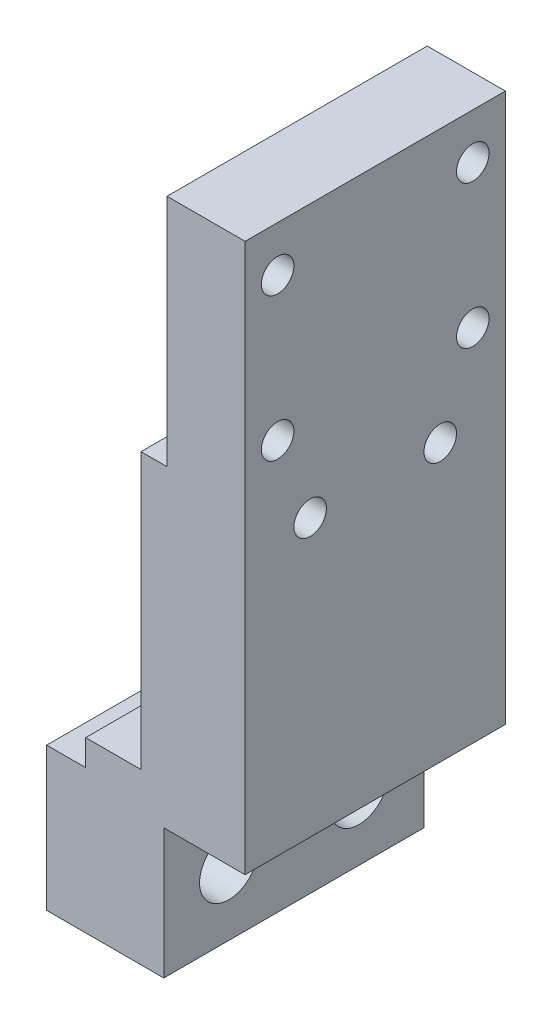
ISO-10303-21;
HEADER;
FILE_DESCRIPTION(('STEP AP214'),'2;1');
FILE_NAME('part.step','',(''),(''),'','','');
FILE_SCHEMA(('AUTOMOTIVE_DESIGN { 1 0 10303 214 1 1 1 1 }'));
ENDSEC;
DATA;
#1=APPLICATION_CONTEXT('core data for automotive mechanical design processes');
#2=APPLICATION_PROTOCOL_DEFINITION('international standard','automotive_design',2000,#1);
#3=PRODUCT_CONTEXT('',#1,'mechanical');
#4=PRODUCT('Part','Part','',(#3));
#5=PRODUCT_RELATED_PRODUCT_CATEGORY('part','',(#4));
#6=PRODUCT_DEFINITION_FORMATION('','',#4);
#7=PRODUCT_DEFINITION_CONTEXT('part definition',#1,'design');
#8=PRODUCT_DEFINITION('design','',#6,#7);
#9=PRODUCT_DEFINITION_SHAPE('','',#8);
#10=(LENGTH_UNIT() NAMED_UNIT(*) SI_UNIT(.MILLI.,.METRE.));
#11=(NAMED_UNIT(*) PLANE_ANGLE_UNIT() SI_UNIT($,.RADIAN.));
#12=(NAMED_UNIT(*) SI_UNIT($,.STERADIAN.) SOLID_ANGLE_UNIT());
#13=UNCERTAINTY_MEASURE_WITH_UNIT(LENGTH_MEASURE(1.E-05),#10,'distance_accuracy_value','');
#14=(GEOMETRIC_REPRESENTATION_CONTEXT(3) GLOBAL_UNCERTAINTY_ASSIGNED_CONTEXT((#13)) GLOBAL_UNIT_ASSIGNED_CONTEXT((#10,
#11,#12)) REPRESENTATION_CONTEXT('',''));
#15=CARTESIAN_POINT('',(0.,0.,0.));
#16=DIRECTION('',(0.,0.,1.));
#17=DIRECTION('',(1.,0.,0.));
#18=AXIS2_PLACEMENT_3D('',#15,#16,#17);
#19=CARTESIAN_POINT('',(-6.00000000000023,11.,20.));
#20=DIRECTION('',(1.,0.,0.));
#21=DIRECTION('',(0.,0.,-1.));
#22=AXIS2_PLACEMENT_3D('',#19,#20,#21);
#23=PLANE('',#22);
#24=DIRECTION('',(0.,-1.,0.));
#25=VECTOR('',#24,1.);
#26=CARTESIAN_POINT('',(-6.00000000000023,11.,0.));
#27=LINE('',#26,#25);
#28=CARTESIAN_POINT('',(-6.00000000000023,13.,0.));
#29=VERTEX_POINT('',#28);
#30=CARTESIAN_POINT('',(-6.00000000000023,11.,0.));
#31=VERTEX_POINT('',#30);
#32=EDGE_CURVE('E159',#29,#31,#27,.T.);
#33=ORIENTED_EDGE('',*,*,#32,.T.);
#34=DIRECTION('',(0.,0.,-1.));
#35=VECTOR('',#34,1.);
#36=CARTESIAN_POINT('',(-6.00000000000023,11.,20.));
#37=LINE('',#36,#35);
#38=CARTESIAN_POINT('',(-6.00000000000023,11.,20.));
#39=VERTEX_POINT('',#38);
#40=EDGE_CURVE('E11',#39,#31,#37,.T.);
#41=ORIENTED_EDGE('',*,*,#40,.F.);
#42=DIRECTION('',(0.,-1.,0.));
#43=VECTOR('',#42,1.);
#44=CARTESIAN_POINT('',(-6.00000000000023,11.,20.));
#45=LINE('',#44,#43);
#46=CARTESIAN_POINT('',(-6.00000000000023,13.,20.));
#47=VERTEX_POINT('',#46);
#48=EDGE_CURVE('E182',#47,#39,#45,.T.);
#49=ORIENTED_EDGE('',*,*,#48,.F.);
#50=DIRECTION('',(0.,0.,-1.));
#51=VECTOR('',#50,1.);
#52=CARTESIAN_POINT('',(-6.00000000000023,13.,20.));
#53=LINE('',#52,#51);
#54=EDGE_CURVE('E155',#47,#29,#53,.T.);
#55=ORIENTED_EDGE('',*,*,#54,.T.);
#56=EDGE_LOOP('',(#33,#41,#49,#55));
#57=FACE_BOUND('',#56,.T.);
#58=ADVANCED_FACE('F37',(#57),#23,.F.);
#59=CARTESIAN_POINT('',(-6.00000000000023,11.,20.));
#60=DIRECTION('',(0.,-1.,0.));
#61=DIRECTION('',(0.,0.,-1.));
#62=AXIS2_PLACEMENT_3D('',#59,#60,#61);
#63=PLANE('',#62);
#64=DIRECTION('',(-1.,0.,0.));
#65=VECTOR('',#64,1.);
#66=CARTESIAN_POINT('',(-6.00000000000023,11.,0.));
#67=LINE('',#66,#65);
#68=CARTESIAN_POINT('',(-9.00000000000034,11.,0.));
#69=VERTEX_POINT('',#68);
#70=EDGE_CURVE('E162',#31,#69,#67,.T.);
#71=ORIENTED_EDGE('',*,*,#70,.T.);
#72=DIRECTION('',(0.,0.,-1.));
#73=VECTOR('',#72,1.);
#74=CARTESIAN_POINT('',(-9.00000000000034,11.,20.));
#75=LINE('',#74,#73);
#76=CARTESIAN_POINT('',(-9.00000000000034,11.,20.));
#77=VERTEX_POINT('',#76);
#78=EDGE_CURVE('E46',#77,#69,#75,.T.);
#79=ORIENTED_EDGE('',*,*,#78,.F.);
#80=DIRECTION('',(-1.,0.,0.));
#81=VECTOR('',#80,1.);
#82=CARTESIAN_POINT('',(-6.00000000000023,11.,20.));
#83=LINE('',#82,#81);
#84=EDGE_CURVE('E110',#39,#77,#83,.T.);
#85=ORIENTED_EDGE('',*,*,#84,.F.);
#86=ORIENTED_EDGE('',*,*,#40,.T.);
#87=EDGE_LOOP('',(#71,#79,#85,#86));
#88=FACE_BOUND('',#87,.T.);
#89=ADVANCED_FACE('F297',(#88),#63,.F.);
#90=CARTESIAN_POINT('',(-9.00000000000034,0.,20.));
#91=DIRECTION('',(1.,0.,0.));
#92=DIRECTION('',(0.,0.,-1.));
#93=AXIS2_PLACEMENT_3D('',#90,#91,#92);
#94=PLANE('',#93);
#95=CARTESIAN_POINT('',(-9.00000000000034,4.96000000000009,5.));
#96=DIRECTION('',(-1.,0.,0.));
#97=DIRECTION('',(0.,0.,1.));
#98=AXIS2_PLACEMENT_3D('',#95,#96,#97);
#99=CIRCLE('',#98,3.99999999999999);
#100=CARTESIAN_POINT('',(-9.00000000000034,4.96000000000009,8.99999999999999));
#101=VERTEX_POINT('',#100);
#102=EDGE_CURVE('E546',#101,#101,#99,.T.);
#103=ORIENTED_EDGE('',*,*,#102,.F.);
#104=EDGE_LOOP('',(#103));
#105=FACE_BOUND('',#104,.T.);
#106=CARTESIAN_POINT('',(-9.00000000000034,4.96000000000009,15.));
#107=DIRECTION('',(-1.,0.,0.));
#108=DIRECTION('',(0.,0.,1.));
#109=AXIS2_PLACEMENT_3D('',#106,#107,#108);
#110=CIRCLE('',#109,3.99999999999999);
#111=CARTESIAN_POINT('',(-9.00000000000034,4.96000000000009,19.));
#112=VERTEX_POINT('',#111);
#113=EDGE_CURVE('E230',#112,#112,#110,.T.);
#114=ORIENTED_EDGE('',*,*,#113,.F.);
#115=EDGE_LOOP('',(#114));
#116=FACE_BOUND('',#115,.T.);
#117=DIRECTION('',(0.,-1.,0.));
#118=VECTOR('',#117,1.);
#119=CARTESIAN_POINT('',(-9.00000000000034,0.,0.));
#120=LINE('',#119,#118);
#121=CARTESIAN_POINT('',(-9.00000000000034,0.,0.));
#122=VERTEX_POINT('',#121);
#123=EDGE_CURVE('E165',#69,#122,#120,.T.);
#124=ORIENTED_EDGE('',*,*,#123,.T.);
#125=DIRECTION('',(0.,0.,-1.));
#126=VECTOR('',#125,1.);
#127=CARTESIAN_POINT('',(-9.00000000000034,0.,20.));
#128=LINE('',#127,#126);
#129=CARTESIAN_POINT('',(-9.00000000000034,0.,20.));
#130=VERTEX_POINT('',#129);
#131=EDGE_CURVE('E201',#130,#122,#128,.T.);
#132=ORIENTED_EDGE('',*,*,#131,.F.);
#133=DIRECTION('',(0.,-1.,0.));
#134=VECTOR('',#133,1.);
#135=CARTESIAN_POINT('',(-9.00000000000034,0.,20.));
#136=LINE('',#135,#134);
#137=EDGE_CURVE('E257',#77,#130,#136,.T.);
#138=ORIENTED_EDGE('',*,*,#137,.F.);
#139=ORIENTED_EDGE('',*,*,#78,.T.);
#140=EDGE_LOOP('',(#124,#132,#138,#139));
#141=FACE_BOUND('',#140,.T.);
#142=ADVANCED_FACE('F301',(#105,#116,#141),#94,.F.);
#143=CARTESIAN_POINT('',(0.,0.,20.));
#144=DIRECTION('',(0.,1.,0.));
#145=DIRECTION('',(0.,0.,1.));
#146=AXIS2_PLACEMENT_3D('',#143,#144,#145);
#147=PLANE('',#146);
#148=DIRECTION('',(1.,0.,0.));
#149=VECTOR('',#148,1.);
#150=CARTESIAN_POINT('',(0.,0.,0.));
#151=LINE('',#150,#149);
#152=CARTESIAN_POINT('',(0.,0.,0.));
#153=VERTEX_POINT('',#152);
#154=EDGE_CURVE('E167',#122,#153,#151,.T.);
#155=ORIENTED_EDGE('',*,*,#154,.T.);
#156=DIRECTION('',(0.,0.,-1.));
#157=VECTOR('',#156,1.);
#158=CARTESIAN_POINT('',(0.,0.,20.));
#159=LINE('',#158,#157);
#160=CARTESIAN_POINT('',(0.,0.,20.));
#161=VERTEX_POINT('',#160);
#162=EDGE_CURVE('E198',#161,#153,#159,.T.);
#163=ORIENTED_EDGE('',*,*,#162,.F.);
#164=DIRECTION('',(1.,0.,0.));
#165=VECTOR('',#164,1.);
#166=CARTESIAN_POINT('',(0.,0.,20.));
#167=LINE('',#166,#165);
#168=EDGE_CURVE('E259',#130,#161,#167,.T.);
#169=ORIENTED_EDGE('',*,*,#168,.F.);
#170=ORIENTED_EDGE('',*,*,#131,.T.);
#171=EDGE_LOOP('',(#155,#163,#169,#170));
#172=FACE_BOUND('',#171,.T.);
#173=ADVANCED_FACE('F305',(#172),#147,.F.);
#174=CARTESIAN_POINT('',(0.,10.,20.));
#175=DIRECTION('',(-1.,0.,0.));
#176=DIRECTION('',(0.,0.,1.));
#177=AXIS2_PLACEMENT_3D('',#174,#175,#176);
#178=PLANE('',#177);
#179=CARTESIAN_POINT('',(0.,4.96000000000009,5.));
#180=DIRECTION('',(-1.,0.,0.));
#181=DIRECTION('',(0.,0.,1.));
#182=AXIS2_PLACEMENT_3D('',#179,#180,#181);
#183=CIRCLE('',#182,2.25);
#184=CARTESIAN_POINT('',(0.,4.96000000000009,7.25));
#185=VERTEX_POINT('',#184);
#186=EDGE_CURVE('E40',#185,#185,#183,.T.);
#187=ORIENTED_EDGE('',*,*,#186,.T.);
#188=EDGE_LOOP('',(#187));
#189=FACE_BOUND('',#188,.T.);
#190=CARTESIAN_POINT('',(0.,4.96000000000009,15.));
#191=DIRECTION('',(-1.,0.,0.));
#192=DIRECTION('',(0.,0.,1.));
#193=AXIS2_PLACEMENT_3D('',#190,#191,#192);
#194=CIRCLE('',#193,2.25);
#195=CARTESIAN_POINT('',(0.,4.96000000000009,17.25));
#196=VERTEX_POINT('',#195);
#197=EDGE_CURVE('E215',#196,#196,#194,.T.);
#198=ORIENTED_EDGE('',*,*,#197,.T.);
#199=EDGE_LOOP('',(#198));
#200=FACE_BOUND('',#199,.T.);
#201=DIRECTION('',(0.,1.,0.));
#202=VECTOR('',#201,1.);
#203=CARTESIAN_POINT('',(0.,10.,0.));
#204=LINE('',#203,#202);
#205=CARTESIAN_POINT('',(0.,10.,0.));
#206=VERTEX_POINT('',#205);
#207=EDGE_CURVE('E169',#153,#206,#204,.T.);
#208=ORIENTED_EDGE('',*,*,#207,.T.);
#209=DIRECTION('',(0.,0.,-1.));
#210=VECTOR('',#209,1.);
#211=CARTESIAN_POINT('',(0.,10.,20.));
#212=LINE('',#211,#210);
#213=CARTESIAN_POINT('',(0.,10.,20.));
#214=VERTEX_POINT('',#213);
#215=EDGE_CURVE('E195',#214,#206,#212,.T.);
#216=ORIENTED_EDGE('',*,*,#215,.F.);
#217=DIRECTION('',(0.,1.,0.));
#218=VECTOR('',#217,1.);
#219=CARTESIAN_POINT('',(0.,10.,20.));
#220=LINE('',#219,#218);
#221=EDGE_CURVE('E261',#161,#214,#220,.T.);
#222=ORIENTED_EDGE('',*,*,#221,.F.);
#223=ORIENTED_EDGE('',*,*,#162,.T.);
#224=EDGE_LOOP('',(#208,#216,#222,#223));
#225=FACE_BOUND('',#224,.T.);
#226=ADVANCED_FACE('F311',(#189,#200,#225),#178,.F.);
#227=CARTESIAN_POINT('',(0.,10.,20.));
#228=DIRECTION('',(0.,1.,0.));
#229=DIRECTION('',(0.,0.,1.));
#230=AXIS2_PLACEMENT_3D('',#227,#228,#229);
#231=PLANE('',#230);
#232=DIRECTION('',(1.,0.,0.));
#233=VECTOR('',#232,1.);
#234=CARTESIAN_POINT('',(0.,10.,0.));
#235=LINE('',#234,#233);
#236=CARTESIAN_POINT('',(6.24999999999964,10.,0.));
#237=VERTEX_POINT('',#236);
#238=EDGE_CURVE('E171',#206,#237,#235,.T.);
#239=ORIENTED_EDGE('',*,*,#238,.T.);
#240=DIRECTION('',(0.,0.,-1.));
#241=VECTOR('',#240,1.);
#242=CARTESIAN_POINT('',(6.24999999999964,10.,20.));
#243=LINE('',#242,#241);
#244=CARTESIAN_POINT('',(6.24999999999964,10.,20.));
#245=VERTEX_POINT('',#244);
#246=EDGE_CURVE('E192',#245,#237,#243,.T.);
#247=ORIENTED_EDGE('',*,*,#246,.F.);
#248=DIRECTION('',(1.,0.,0.));
#249=VECTOR('',#248,1.);
#250=CARTESIAN_POINT('',(0.,10.,20.));
#251=LINE('',#250,#249);
#252=EDGE_CURVE('E263',#214,#245,#251,.T.);
#253=ORIENTED_EDGE('',*,*,#252,.F.);
#254=ORIENTED_EDGE('',*,*,#215,.T.);
#255=EDGE_LOOP('',(#239,#247,#253,#254));
#256=FACE_BOUND('',#255,.T.);
#257=ADVANCED_FACE('F315',(#256),#231,.F.);
#258=CARTESIAN_POINT('',(6.24999999999964,10.,20.));
#259=DIRECTION('',(-1.,0.,0.));
#260=DIRECTION('',(0.,0.,1.));
#261=AXIS2_PLACEMENT_3D('',#258,#259,#260);
#262=PLANE('',#261);
#263=CARTESIAN_POINT('',(6.24999999999965,48.6600000000001,2.5));
#264=DIRECTION('',(1.,0.,0.));
#265=DIRECTION('',(0.,0.,-1.));
#266=AXIS2_PLACEMENT_3D('',#263,#264,#265);
#267=CIRCLE('',#266,1.24999999999999);
#268=CARTESIAN_POINT('',(6.24999999999965,48.6600000000001,1.25000000000001));
#269=VERTEX_POINT('',#268);
#270=EDGE_CURVE('E217',#269,#269,#267,.T.);
#271=ORIENTED_EDGE('',*,*,#270,.F.);
#272=EDGE_LOOP('',(#271));
#273=FACE_BOUND('',#272,.T.);
#274=CARTESIAN_POINT('',(6.24999999999965,37.6600000000001,2.5));
#275=DIRECTION('',(1.,0.,0.));
#276=DIRECTION('',(0.,0.,-1.));
#277=AXIS2_PLACEMENT_3D('',#274,#275,#276);
#278=CIRCLE('',#277,1.24999999999999);
#279=CARTESIAN_POINT('',(6.24999999999965,37.6600000000001,1.25000000000001));
#280=VERTEX_POINT('',#279);
#281=EDGE_CURVE('E236',#280,#280,#278,.T.);
#282=ORIENTED_EDGE('',*,*,#281,.F.);
#283=EDGE_LOOP('',(#282));
#284=FACE_BOUND('',#283,.T.);
#285=CARTESIAN_POINT('',(6.24999999999965,31.2600000000001,5.));
#286=DIRECTION('',(1.,0.,0.));
#287=DIRECTION('',(0.,0.,-1.));
#288=AXIS2_PLACEMENT_3D('',#285,#286,#287);
#289=CIRCLE('',#288,1.24999999999999);
#290=CARTESIAN_POINT('',(6.24999999999965,31.2600000000001,3.75000000000001));
#291=VERTEX_POINT('',#290);
#292=EDGE_CURVE('E214',#291,#291,#289,.T.);
#293=ORIENTED_EDGE('',*,*,#292,.F.);
#294=EDGE_LOOP('',(#293));
#295=FACE_BOUND('',#294,.T.);
#296=CARTESIAN_POINT('',(6.24999999999965,31.2600000000001,15.));
#297=DIRECTION('',(1.,0.,0.));
#298=DIRECTION('',(0.,0.,-1.));
#299=AXIS2_PLACEMENT_3D('',#296,#297,#298);
#300=CIRCLE('',#299,1.24999999999999);
#301=CARTESIAN_POINT('',(6.24999999999965,31.2600000000001,13.75));
#302=VERTEX_POINT('',#301);
#303=EDGE_CURVE('E213',#302,#302,#300,.T.);
#304=ORIENTED_EDGE('',*,*,#303,.F.);
#305=EDGE_LOOP('',(#304));
#306=FACE_BOUND('',#305,.T.);
#307=CARTESIAN_POINT('',(6.24999999999965,37.6600000000001,17.5));
#308=DIRECTION('',(1.,0.,0.));
#309=DIRECTION('',(0.,0.,-1.));
#310=AXIS2_PLACEMENT_3D('',#307,#308,#309);
#311=CIRCLE('',#310,1.24999999999999);
#312=CARTESIAN_POINT('',(6.24999999999965,37.6600000000001,16.25));
#313=VERTEX_POINT('',#312);
#314=EDGE_CURVE('E210',#313,#313,#311,.T.);
#315=ORIENTED_EDGE('',*,*,#314,.F.);
#316=EDGE_LOOP('',(#315));
#317=FACE_BOUND('',#316,.T.);
#318=CARTESIAN_POINT('',(6.24999999999965,48.6600000000001,17.5));
#319=DIRECTION('',(1.,0.,0.));
#320=DIRECTION('',(0.,0.,-1.));
#321=AXIS2_PLACEMENT_3D('',#318,#319,#320);
#322=CIRCLE('',#321,1.24999999999999);
#323=CARTESIAN_POINT('',(6.24999999999965,48.6600000000001,16.25));
#324=VERTEX_POINT('',#323);
#325=EDGE_CURVE('E209',#324,#324,#322,.T.);
#326=ORIENTED_EDGE('',*,*,#325,.F.);
#327=EDGE_LOOP('',(#326));
#328=FACE_BOUND('',#327,.T.);
#329=DIRECTION('',(0.,1.,0.));
#330=VECTOR('',#329,1.);
#331=CARTESIAN_POINT('',(6.24999999999964,10.,0.));
#332=LINE('',#331,#330);
#333=CARTESIAN_POINT('',(6.24999999999964,52.1600000000001,0.));
#334=VERTEX_POINT('',#333);
#335=EDGE_CURVE('E173',#237,#334,#332,.T.);
#336=ORIENTED_EDGE('',*,*,#335,.T.);
#337=DIRECTION('',(0.,0.,-1.));
#338=VECTOR('',#337,1.);
#339=CARTESIAN_POINT('',(6.24999999999964,52.1600000000001,20.));
#340=LINE('',#339,#338);
#341=CARTESIAN_POINT('',(6.24999999999964,52.1600000000001,20.));
#342=VERTEX_POINT('',#341);
#343=EDGE_CURVE('E189',#342,#334,#340,.T.);
#344=ORIENTED_EDGE('',*,*,#343,.F.);
#345=DIRECTION('',(0.,1.,0.));
#346=VECTOR('',#345,1.);
#347=CARTESIAN_POINT('',(6.24999999999964,10.,20.));
#348=LINE('',#347,#346);
#349=EDGE_CURVE('E265',#245,#342,#348,.T.);
#350=ORIENTED_EDGE('',*,*,#349,.F.);
#351=ORIENTED_EDGE('',*,*,#246,.T.);
#352=EDGE_LOOP('',(#336,#344,#350,#351));
#353=FACE_BOUND('',#352,.T.);
#354=ADVANCED_FACE('F319',(#273,#284,#295,#306,#317,#328,#353),#262,.F.);
#355=CARTESIAN_POINT('',(0.249999999998085,52.1600000000001,20.));
#356=DIRECTION('',(0.,-1.,0.));
#357=DIRECTION('',(0.,0.,-1.));
#358=AXIS2_PLACEMENT_3D('',#355,#356,#357);
#359=PLANE('',#358);
#360=DIRECTION('',(-1.,0.,0.));
#361=VECTOR('',#360,1.);
#362=CARTESIAN_POINT('',(0.249999999998085,52.1600000000001,0.));
#363=LINE('',#362,#361);
#364=CARTESIAN_POINT('',(0.249999999998085,52.1600000000001,0.));
#365=VERTEX_POINT('',#364);
#366=EDGE_CURVE('E175',#334,#365,#363,.T.);
#367=ORIENTED_EDGE('',*,*,#366,.T.);
#368=DIRECTION('',(0.,0.,-1.));
#369=VECTOR('',#368,1.);
#370=CARTESIAN_POINT('',(0.249999999998085,52.1600000000001,20.));
#371=LINE('',#370,#369);
#372=CARTESIAN_POINT('',(0.249999999998085,52.1600000000001,20.));
#373=VERTEX_POINT('',#372);
#374=EDGE_CURVE('E186',#373,#365,#371,.T.);
#375=ORIENTED_EDGE('',*,*,#374,.F.);
#376=DIRECTION('',(-1.,0.,0.));
#377=VECTOR('',#376,1.);
#378=CARTESIAN_POINT('',(0.249999999998085,52.1600000000001,20.));
#379=LINE('',#378,#377);
#380=EDGE_CURVE('E267',#342,#373,#379,.T.);
#381=ORIENTED_EDGE('',*,*,#380,.F.);
#382=ORIENTED_EDGE('',*,*,#343,.T.);
#383=EDGE_LOOP('',(#367,#375,#381,#382));
#384=FACE_BOUND('',#383,.T.);
#385=ADVANCED_FACE('F273',(#384),#359,.F.);
#386=CARTESIAN_POINT('',(0.249999999998085,34.1600000000001,20.));
#387=DIRECTION('',(1.,0.,0.));
#388=DIRECTION('',(0.,0.,-1.));
#389=AXIS2_PLACEMENT_3D('',#386,#387,#388);
#390=PLANE('',#389);
#391=CARTESIAN_POINT('',(0.249999999998085,48.6600000000001,2.5));
#392=DIRECTION('',(1.,0.,0.));
#393=DIRECTION('',(0.,0.,-1.));
#394=AXIS2_PLACEMENT_3D('',#391,#392,#393);
#395=CIRCLE('',#394,1.24999999999999);
#396=CARTESIAN_POINT('',(0.249999999998085,48.6600000000001,1.25000000000001));
#397=VERTEX_POINT('',#396);
#398=EDGE_CURVE('E222',#397,#397,#395,.T.);
#399=ORIENTED_EDGE('',*,*,#398,.T.);
#400=EDGE_LOOP('',(#399));
#401=FACE_BOUND('',#400,.T.);
#402=CARTESIAN_POINT('',(0.249999999998085,37.6600000000001,2.5));
#403=DIRECTION('',(1.,0.,0.));
#404=DIRECTION('',(0.,0.,-1.));
#405=AXIS2_PLACEMENT_3D('',#402,#403,#404);
#406=CIRCLE('',#405,1.24999999999999);
#407=CARTESIAN_POINT('',(0.249999999998085,37.6600000000001,1.25000000000001));
#408=VERTEX_POINT('',#407);
#409=EDGE_CURVE('E239',#408,#408,#406,.T.);
#410=ORIENTED_EDGE('',*,*,#409,.T.);
#411=EDGE_LOOP('',(#410));
#412=FACE_BOUND('',#411,.T.);
#413=CARTESIAN_POINT('',(0.249999999998085,37.6600000000001,17.5));
#414=DIRECTION('',(1.,0.,0.));
#415=DIRECTION('',(0.,0.,-1.));
#416=AXIS2_PLACEMENT_3D('',#413,#414,#415);
#417=CIRCLE('',#416,1.24999999999999);
#418=CARTESIAN_POINT('',(0.249999999998085,37.6600000000001,16.25));
#419=VERTEX_POINT('',#418);
#420=EDGE_CURVE('E206',#419,#419,#417,.T.);
#421=ORIENTED_EDGE('',*,*,#420,.T.);
#422=EDGE_LOOP('',(#421));
#423=FACE_BOUND('',#422,.T.);
#424=CARTESIAN_POINT('',(0.249999999998085,48.6600000000001,17.5));
#425=DIRECTION('',(1.,0.,0.));
#426=DIRECTION('',(0.,0.,-1.));
#427=AXIS2_PLACEMENT_3D('',#424,#425,#426);
#428=CIRCLE('',#427,1.24999999999999);
#429=CARTESIAN_POINT('',(0.249999999998085,48.6600000000001,16.25));
#430=VERTEX_POINT('',#429);
#431=EDGE_CURVE('E163',#430,#430,#428,.T.);
#432=ORIENTED_EDGE('',*,*,#431,.T.);
#433=EDGE_LOOP('',(#432));
#434=FACE_BOUND('',#433,.T.);
#435=DIRECTION('',(0.,-1.,0.));
#436=VECTOR('',#435,1.);
#437=CARTESIAN_POINT('',(0.249999999998085,34.1600000000001,0.));
#438=LINE('',#437,#436);
#439=CARTESIAN_POINT('',(0.249999999998085,34.1600000000001,0.));
#440=VERTEX_POINT('',#439);
#441=EDGE_CURVE('E177',#365,#440,#438,.T.);
#442=ORIENTED_EDGE('',*,*,#441,.T.);
#443=DIRECTION('',(0.,0.,-1.));
#444=VECTOR('',#443,1.);
#445=CARTESIAN_POINT('',(0.249999999998085,34.1600000000001,20.));
#446=LINE('',#445,#444);
#447=CARTESIAN_POINT('',(0.249999999998085,34.1600000000001,20.));
#448=VERTEX_POINT('',#447);
#449=EDGE_CURVE('E150',#448,#440,#446,.T.);
#450=ORIENTED_EDGE('',*,*,#449,.F.);
#451=DIRECTION('',(0.,-1.,0.));
#452=VECTOR('',#451,1.);
#453=CARTESIAN_POINT('',(0.249999999998085,34.1600000000001,20.));
#454=LINE('',#453,#452);
#455=EDGE_CURVE('E141',#373,#448,#454,.T.);
#456=ORIENTED_EDGE('',*,*,#455,.F.);
#457=ORIENTED_EDGE('',*,*,#374,.T.);
#458=EDGE_LOOP('',(#442,#450,#456,#457));
#459=FACE_BOUND('',#458,.T.);
#460=ADVANCED_FACE('F277',(#401,#412,#423,#434,#459),#390,.F.);
#461=CARTESIAN_POINT('',(0.249999999998085,34.1600000000001,20.));
#462=DIRECTION('',(0.,-1.,0.));
#463=DIRECTION('',(0.,0.,-1.));
#464=AXIS2_PLACEMENT_3D('',#461,#462,#463);
#465=PLANE('',#464);
#466=DIRECTION('',(-1.,0.,0.));
#467=VECTOR('',#466,1.);
#468=CARTESIAN_POINT('',(0.249999999998085,34.1600000000001,0.));
#469=LINE('',#468,#467);
#470=CARTESIAN_POINT('',(-1.75000000000214,34.1600000000001,0.));
#471=VERTEX_POINT('',#470);
#472=EDGE_CURVE('E149',#440,#471,#469,.T.);
#473=ORIENTED_EDGE('',*,*,#472,.T.);
#474=DIRECTION('',(0.,0.,-1.));
#475=VECTOR('',#474,1.);
#476=CARTESIAN_POINT('',(-1.75000000000214,34.1600000000001,20.));
#477=LINE('',#476,#475);
#478=CARTESIAN_POINT('',(-1.75000000000214,34.1600000000001,20.));
#479=VERTEX_POINT('',#478);
#480=EDGE_CURVE('E146',#479,#471,#477,.T.);
#481=ORIENTED_EDGE('',*,*,#480,.F.);
#482=DIRECTION('',(-1.,0.,0.));
#483=VECTOR('',#482,1.);
#484=CARTESIAN_POINT('',(0.249999999998085,34.1600000000001,20.));
#485=LINE('',#484,#483);
#486=EDGE_CURVE('E135',#448,#479,#485,.T.);
#487=ORIENTED_EDGE('',*,*,#486,.F.);
#488=ORIENTED_EDGE('',*,*,#449,.T.);
#489=EDGE_LOOP('',(#473,#481,#487,#488));
#490=FACE_BOUND('',#489,.T.);
#491=ADVANCED_FACE('F147',(#490),#465,.F.);
#492=CARTESIAN_POINT('',(-1.75000000000214,34.1600000000001,20.));
#493=DIRECTION('',(1.,0.,0.));
#494=DIRECTION('',(0.,0.,-1.));
#495=AXIS2_PLACEMENT_3D('',#492,#493,#494);
#496=PLANE('',#495);
#497=CARTESIAN_POINT('',(-1.75000000000214,31.2600000000001,5.));
#498=DIRECTION('',(1.,0.,0.));
#499=DIRECTION('',(0.,0.,-1.));
#500=AXIS2_PLACEMENT_3D('',#497,#498,#499);
#501=CIRCLE('',#500,1.24999999999999);
#502=CARTESIAN_POINT('',(-1.75000000000214,31.2600000000001,3.75000000000001));
#503=VERTEX_POINT('',#502);
#504=EDGE_CURVE('E211',#503,#503,#501,.T.);
#505=ORIENTED_EDGE('',*,*,#504,.T.);
#506=EDGE_LOOP('',(#505));
#507=FACE_BOUND('',#506,.T.);
#508=CARTESIAN_POINT('',(-1.75000000000214,31.2600000000001,15.));
#509=DIRECTION('',(1.,0.,0.));
#510=DIRECTION('',(0.,0.,-1.));
#511=AXIS2_PLACEMENT_3D('',#508,#509,#510);
#512=CIRCLE('',#511,1.24999999999999);
#513=CARTESIAN_POINT('',(-1.75000000000214,31.2600000000001,13.75));
#514=VERTEX_POINT('',#513);
#515=EDGE_CURVE('E246',#514,#514,#512,.T.);
#516=ORIENTED_EDGE('',*,*,#515,.T.);
#517=EDGE_LOOP('',(#516));
#518=FACE_BOUND('',#517,.T.);
#519=DIRECTION('',(0.,-1.,0.));
#520=VECTOR('',#519,1.);
#521=CARTESIAN_POINT('',(-1.75000000000214,34.1600000000001,0.));
#522=LINE('',#521,#520);
#523=CARTESIAN_POINT('',(-1.75000000000214,13.,0.));
#524=VERTEX_POINT('',#523);
#525=EDGE_CURVE('E96',#471,#524,#522,.T.);
#526=ORIENTED_EDGE('',*,*,#525,.T.);
#527=DIRECTION('',(0.,0.,-1.));
#528=VECTOR('',#527,1.);
#529=CARTESIAN_POINT('',(-1.75000000000214,13.,20.));
#530=LINE('',#529,#528);
#531=CARTESIAN_POINT('',(-1.75000000000214,13.,20.));
#532=VERTEX_POINT('',#531);
#533=EDGE_CURVE('E151',#532,#524,#530,.T.);
#534=ORIENTED_EDGE('',*,*,#533,.F.);
#535=DIRECTION('',(0.,-1.,0.));
#536=VECTOR('',#535,1.);
#537=CARTESIAN_POINT('',(-1.75000000000214,34.1600000000001,20.));
#538=LINE('',#537,#536);
#539=EDGE_CURVE('E139',#479,#532,#538,.T.);
#540=ORIENTED_EDGE('',*,*,#539,.F.);
#541=ORIENTED_EDGE('',*,*,#480,.T.);
#542=EDGE_LOOP('',(#526,#534,#540,#541));
#543=FACE_BOUND('',#542,.T.);
#544=ADVANCED_FACE('F153',(#507,#518,#543),#496,.F.);
#545=CARTESIAN_POINT('',(-6.00000000000023,13.,20.));
#546=DIRECTION('',(0.,-1.,0.));
#547=DIRECTION('',(0.,0.,-1.));
#548=AXIS2_PLACEMENT_3D('',#545,#546,#547);
#549=PLANE('',#548);
#550=DIRECTION('',(-1.,0.,0.));
#551=VECTOR('',#550,1.);
#552=CARTESIAN_POINT('',(-6.00000000000023,13.,0.));
#553=LINE('',#552,#551);
#554=EDGE_CURVE('E102',#524,#29,#553,.T.);
#555=ORIENTED_EDGE('',*,*,#554,.T.);
#556=ORIENTED_EDGE('',*,*,#54,.F.);
#557=DIRECTION('',(-1.,0.,0.));
#558=VECTOR('',#557,1.);
#559=CARTESIAN_POINT('',(-6.00000000000023,13.,20.));
#560=LINE('',#559,#558);
#561=EDGE_CURVE('E55',#532,#47,#560,.T.);
#562=ORIENTED_EDGE('',*,*,#561,.F.);
#563=ORIENTED_EDGE('',*,*,#533,.T.);
#564=EDGE_LOOP('',(#555,#556,#562,#563));
#565=FACE_BOUND('',#564,.T.);
#566=ADVANCED_FACE('F285',(#565),#549,.F.);
#567=CARTESIAN_POINT('',(0.,0.,20.));
#568=DIRECTION('',(0.,0.,-1.));
#569=DIRECTION('',(-1.,0.,0.));
#570=AXIS2_PLACEMENT_3D('',#567,#568,#569);
#571=PLANE('',#570);
#572=ORIENTED_EDGE('',*,*,#48,.T.);
#573=ORIENTED_EDGE('',*,*,#84,.T.);
#574=ORIENTED_EDGE('',*,*,#137,.T.);
#575=ORIENTED_EDGE('',*,*,#168,.T.);
#576=ORIENTED_EDGE('',*,*,#221,.T.);
#577=ORIENTED_EDGE('',*,*,#252,.T.);
#578=ORIENTED_EDGE('',*,*,#349,.T.);
#579=ORIENTED_EDGE('',*,*,#380,.T.);
#580=ORIENTED_EDGE('',*,*,#455,.T.);
#581=ORIENTED_EDGE('',*,*,#486,.T.);
#582=ORIENTED_EDGE('',*,*,#539,.T.);
#583=ORIENTED_EDGE('',*,*,#561,.T.);
#584=EDGE_LOOP('',(#572,#573,#574,#575,#576,#577,#578,#579,#580,#581,#582,#583));
#585=FACE_BOUND('',#584,.T.);
#586=ADVANCED_FACE('F137',(#585),#571,.F.);
#587=CARTESIAN_POINT('',(0.,0.,0.));
#588=DIRECTION('',(0.,0.,-1.));
#589=DIRECTION('',(-1.,0.,0.));
#590=AXIS2_PLACEMENT_3D('',#587,#588,#589);
#591=PLANE('',#590);
#592=ORIENTED_EDGE('',*,*,#32,.F.);
#593=ORIENTED_EDGE('',*,*,#554,.F.);
#594=ORIENTED_EDGE('',*,*,#525,.F.);
#595=ORIENTED_EDGE('',*,*,#472,.F.);
#596=ORIENTED_EDGE('',*,*,#441,.F.);
#597=ORIENTED_EDGE('',*,*,#366,.F.);
#598=ORIENTED_EDGE('',*,*,#335,.F.);
#599=ORIENTED_EDGE('',*,*,#238,.F.);
#600=ORIENTED_EDGE('',*,*,#207,.F.);
#601=ORIENTED_EDGE('',*,*,#154,.F.);
#602=ORIENTED_EDGE('',*,*,#123,.F.);
#603=ORIENTED_EDGE('',*,*,#70,.F.);
#604=EDGE_LOOP('',(#592,#593,#594,#595,#596,#597,#598,#599,#600,#601,#602,#603));
#605=FACE_BOUND('',#604,.T.);
#606=ADVANCED_FACE('F280',(#605),#591,.T.);
#607=CARTESIAN_POINT('',(6.24999999999964,48.6600000000001,17.5));
#608=DIRECTION('',(1.,0.,0.));
#609=DIRECTION('',(0.,0.,-1.));
#610=AXIS2_PLACEMENT_3D('',#607,#608,#609);
#611=CYLINDRICAL_SURFACE('',#610,1.24999999999999);
#612=ORIENTED_EDGE('',*,*,#325,.T.);
#613=EDGE_LOOP('',(#612));
#614=FACE_BOUND('',#613,.T.);
#615=ORIENTED_EDGE('',*,*,#431,.F.);
#616=EDGE_LOOP('',(#615));
#617=FACE_BOUND('',#616,.T.);
#618=ADVANCED_FACE('F348',(#614,#617),#611,.F.);
#619=CARTESIAN_POINT('',(6.24999999999964,37.6600000000001,17.5));
#620=DIRECTION('',(1.,0.,0.));
#621=DIRECTION('',(0.,0.,-1.));
#622=AXIS2_PLACEMENT_3D('',#619,#620,#621);
#623=CYLINDRICAL_SURFACE('',#622,1.24999999999999);
#624=ORIENTED_EDGE('',*,*,#314,.T.);
#625=EDGE_LOOP('',(#624));
#626=FACE_BOUND('',#625,.T.);
#627=ORIENTED_EDGE('',*,*,#420,.F.);
#628=EDGE_LOOP('',(#627));
#629=FACE_BOUND('',#628,.T.);
#630=ADVANCED_FACE('F354',(#626,#629),#623,.F.);
#631=CARTESIAN_POINT('',(6.24999999999964,31.2600000000001,15.));
#632=DIRECTION('',(1.,0.,0.));
#633=DIRECTION('',(0.,0.,-1.));
#634=AXIS2_PLACEMENT_3D('',#631,#632,#633);
#635=CYLINDRICAL_SURFACE('',#634,1.24999999999999);
#636=ORIENTED_EDGE('',*,*,#303,.T.);
#637=EDGE_LOOP('',(#636));
#638=FACE_BOUND('',#637,.T.);
#639=ORIENTED_EDGE('',*,*,#515,.F.);
#640=EDGE_LOOP('',(#639));
#641=FACE_BOUND('',#640,.T.);
#642=ADVANCED_FACE('F366',(#638,#641),#635,.F.);
#643=CARTESIAN_POINT('',(6.24999999999964,31.2600000000001,5.));
#644=DIRECTION('',(1.,0.,0.));
#645=DIRECTION('',(0.,0.,-1.));
#646=AXIS2_PLACEMENT_3D('',#643,#644,#645);
#647=CYLINDRICAL_SURFACE('',#646,1.24999999999999);
#648=ORIENTED_EDGE('',*,*,#292,.T.);
#649=EDGE_LOOP('',(#648));
#650=FACE_BOUND('',#649,.T.);
#651=ORIENTED_EDGE('',*,*,#504,.F.);
#652=EDGE_LOOP('',(#651));
#653=FACE_BOUND('',#652,.T.);
#654=ADVANCED_FACE('F377',(#650,#653),#647,.F.);
#655=CARTESIAN_POINT('',(6.24999999999964,37.6600000000001,2.5));
#656=DIRECTION('',(1.,0.,0.));
#657=DIRECTION('',(0.,0.,-1.));
#658=AXIS2_PLACEMENT_3D('',#655,#656,#657);
#659=CYLINDRICAL_SURFACE('',#658,1.24999999999999);
#660=ORIENTED_EDGE('',*,*,#281,.T.);
#661=EDGE_LOOP('',(#660));
#662=FACE_BOUND('',#661,.T.);
#663=ORIENTED_EDGE('',*,*,#409,.F.);
#664=EDGE_LOOP('',(#663));
#665=FACE_BOUND('',#664,.T.);
#666=ADVANCED_FACE('F388',(#662,#665),#659,.F.);
#667=CARTESIAN_POINT('',(6.24999999999964,48.6600000000001,2.5));
#668=DIRECTION('',(1.,0.,0.));
#669=DIRECTION('',(0.,0.,-1.));
#670=AXIS2_PLACEMENT_3D('',#667,#668,#669);
#671=CYLINDRICAL_SURFACE('',#670,1.24999999999999);
#672=ORIENTED_EDGE('',*,*,#270,.T.);
#673=EDGE_LOOP('',(#672));
#674=FACE_BOUND('',#673,.T.);
#675=ORIENTED_EDGE('',*,*,#398,.F.);
#676=EDGE_LOOP('',(#675));
#677=FACE_BOUND('',#676,.T.);
#678=ADVANCED_FACE('F399',(#674,#677),#671,.F.);
#679=CARTESIAN_POINT('',(-9.00000000000034,4.96000000000009,15.));
#680=DIRECTION('',(-1.,0.,0.));
#681=DIRECTION('',(0.,0.,1.));
#682=AXIS2_PLACEMENT_3D('',#679,#680,#681);
#683=CYLINDRICAL_SURFACE('',#682,2.25);
#684=CARTESIAN_POINT('',(-4.60000000000034,4.96000000000009,15.));
#685=DIRECTION('',(-1.,0.,0.));
#686=DIRECTION('',(0.,0.,1.));
#687=AXIS2_PLACEMENT_3D('',#684,#685,#686);
#688=CIRCLE('',#687,2.25);
#689=CARTESIAN_POINT('',(-4.60000000000034,4.96000000000009,17.25));
#690=VERTEX_POINT('',#689);
#691=EDGE_CURVE('E218',#690,#690,#688,.T.);
#692=ORIENTED_EDGE('',*,*,#691,.T.);
#693=EDGE_LOOP('',(#692));
#694=FACE_BOUND('',#693,.T.);
#695=ORIENTED_EDGE('',*,*,#197,.F.);
#696=EDGE_LOOP('',(#695));
#697=FACE_BOUND('',#696,.T.);
#698=ADVANCED_FACE('F410',(#694,#697),#683,.F.);
#699=CARTESIAN_POINT('',(-4.60000000000034,7.21000000000009,15.));
#700=DIRECTION('',(1.,0.,0.));
#701=DIRECTION('',(0.,0.,-1.));
#702=AXIS2_PLACEMENT_3D('',#699,#700,#701);
#703=PLANE('',#702);
#704=ORIENTED_EDGE('',*,*,#691,.F.);
#705=EDGE_LOOP('',(#704));
#706=FACE_BOUND('',#705,.T.);
#707=CARTESIAN_POINT('',(-4.60000000000034,4.96000000000009,15.));
#708=DIRECTION('',(-1.,0.,0.));
#709=DIRECTION('',(0.,0.,1.));
#710=AXIS2_PLACEMENT_3D('',#707,#708,#709);
#711=CIRCLE('',#710,4.);
#712=CARTESIAN_POINT('',(-4.60000000000034,4.96000000000009,19.));
#713=VERTEX_POINT('',#712);
#714=EDGE_CURVE('E225',#713,#713,#711,.T.);
#715=ORIENTED_EDGE('',*,*,#714,.T.);
#716=EDGE_LOOP('',(#715));
#717=FACE_BOUND('',#716,.T.);
#718=ADVANCED_FACE('F435',(#706,#717),#703,.F.);
#719=CARTESIAN_POINT('',(-9.00000000000034,4.96000000000009,15.));
#720=DIRECTION('',(-1.,0.,0.));
#721=DIRECTION('',(0.,0.,1.));
#722=AXIS2_PLACEMENT_3D('',#719,#720,#721);
#723=CYLINDRICAL_SURFACE('',#722,3.99999999999999);
#724=ORIENTED_EDGE('',*,*,#714,.F.);
#725=EDGE_LOOP('',(#724));
#726=FACE_BOUND('',#725,.T.);
#727=ORIENTED_EDGE('',*,*,#113,.T.);
#728=EDGE_LOOP('',(#727));
#729=FACE_BOUND('',#728,.T.);
#730=ADVANCED_FACE('F444',(#726,#729),#723,.F.);
#731=CARTESIAN_POINT('',(-9.00000000000034,4.96000000000009,5.));
#732=DIRECTION('',(-1.,0.,0.));
#733=DIRECTION('',(0.,0.,1.));
#734=AXIS2_PLACEMENT_3D('',#731,#732,#733);
#735=CYLINDRICAL_SURFACE('',#734,2.25);
#736=CARTESIAN_POINT('',(-4.60000000000034,4.96000000000009,5.));
#737=DIRECTION('',(-1.,0.,0.));
#738=DIRECTION('',(0.,0.,1.));
#739=AXIS2_PLACEMENT_3D('',#736,#737,#738);
#740=CIRCLE('',#739,2.25);
#741=CARTESIAN_POINT('',(-4.60000000000034,4.96000000000009,7.25));
#742=VERTEX_POINT('',#741);
#743=EDGE_CURVE('E548',#742,#742,#740,.T.);
#744=ORIENTED_EDGE('',*,*,#743,.T.);
#745=EDGE_LOOP('',(#744));
#746=FACE_BOUND('',#745,.T.);
#747=ORIENTED_EDGE('',*,*,#186,.F.);
#748=EDGE_LOOP('',(#747));
#749=FACE_BOUND('',#748,.T.);
#750=ADVANCED_FACE('F454',(#746,#749),#735,.F.);
#751=CARTESIAN_POINT('',(-4.60000000000034,7.21000000000009,5.));
#752=DIRECTION('',(1.,0.,0.));
#753=DIRECTION('',(0.,0.,-1.));
#754=AXIS2_PLACEMENT_3D('',#751,#752,#753);
#755=PLANE('',#754);
#756=ORIENTED_EDGE('',*,*,#743,.F.);
#757=EDGE_LOOP('',(#756));
#758=FACE_BOUND('',#757,.T.);
#759=CARTESIAN_POINT('',(-4.60000000000034,4.96000000000009,5.));
#760=DIRECTION('',(-1.,0.,0.));
#761=DIRECTION('',(0.,0.,1.));
#762=AXIS2_PLACEMENT_3D('',#759,#760,#761);
#763=CIRCLE('',#762,4.);
#764=CARTESIAN_POINT('',(-4.60000000000034,4.96000000000009,9.));
#765=VERTEX_POINT('',#764);
#766=EDGE_CURVE('E543',#765,#765,#763,.T.);
#767=ORIENTED_EDGE('',*,*,#766,.T.);
#768=EDGE_LOOP('',(#767));
#769=FACE_BOUND('',#768,.T.);
#770=ADVANCED_FACE('F464',(#758,#769),#755,.F.);
#771=CARTESIAN_POINT('',(-9.00000000000034,4.96000000000009,5.));
#772=DIRECTION('',(-1.,0.,0.));
#773=DIRECTION('',(0.,0.,1.));
#774=AXIS2_PLACEMENT_3D('',#771,#772,#773);
#775=CYLINDRICAL_SURFACE('',#774,3.99999999999999);
#776=ORIENTED_EDGE('',*,*,#766,.F.);
#777=EDGE_LOOP('',(#776));
#778=FACE_BOUND('',#777,.T.);
#779=ORIENTED_EDGE('',*,*,#102,.T.);
#780=EDGE_LOOP('',(#779));
#781=FACE_BOUND('',#780,.T.);
#782=ADVANCED_FACE('F474',(#778,#781),#775,.F.);
#783=CLOSED_SHELL('',(#58,#89,#142,#173,#226,#257,#354,#385,#460,#491,#544,#566,#586,#606,#618,
#630,#642,#654,#666,#678,#698,#718,#730,#750,#770,#782));
#784=MANIFOLD_SOLID_BREP('B2',#783);
#785=ADVANCED_BREP_SHAPE_REPRESENTATION('',(#18,#784),#14);
#786=SHAPE_DEFINITION_REPRESENTATION(#9,#785);
ENDSEC;
END-ISO-10303-21;
